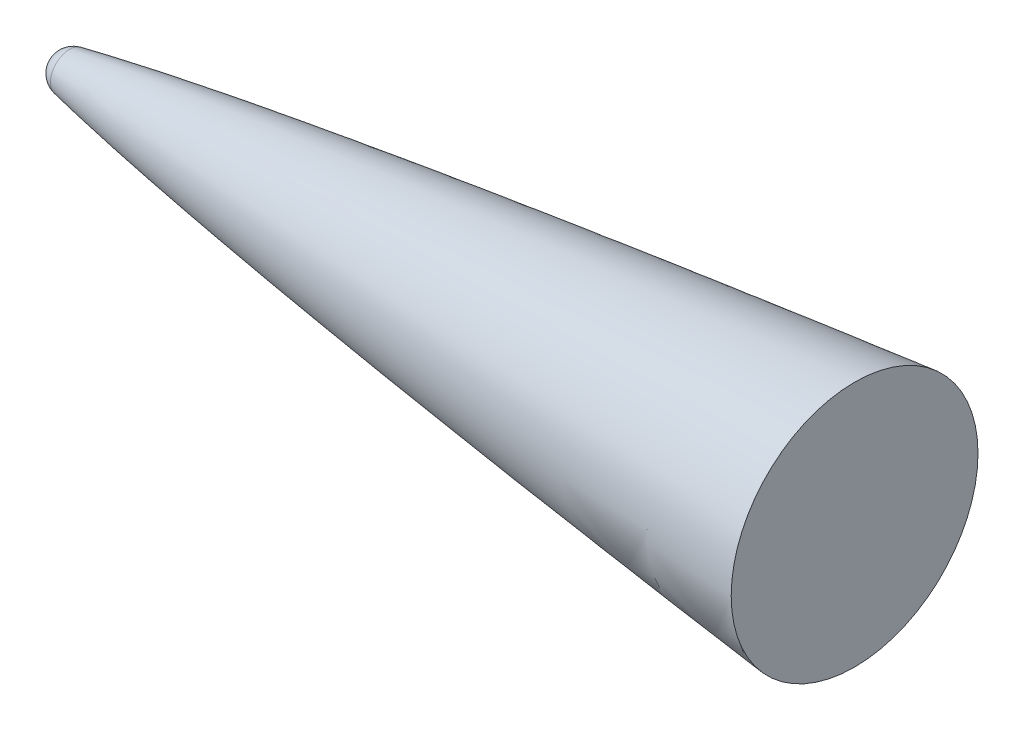
ISO-10303-21;
HEADER;
FILE_DESCRIPTION(('STEP AP214'),'2;1');
FILE_NAME('part.step','',(''),(''),'','','');
FILE_SCHEMA(('AUTOMOTIVE_DESIGN { 1 0 10303 214 1 1 1 1 }'));
ENDSEC;
DATA;
#1=APPLICATION_CONTEXT('core data for automotive mechanical design processes');
#2=APPLICATION_PROTOCOL_DEFINITION('international standard','automotive_design',2000,#1);
#3=PRODUCT_CONTEXT('',#1,'mechanical');
#4=PRODUCT('Part','Part','',(#3));
#5=PRODUCT_RELATED_PRODUCT_CATEGORY('part','',(#4));
#6=PRODUCT_DEFINITION_FORMATION('','',#4);
#7=PRODUCT_DEFINITION_CONTEXT('part definition',#1,'design');
#8=PRODUCT_DEFINITION('design','',#6,#7);
#9=PRODUCT_DEFINITION_SHAPE('','',#8);
#10=(LENGTH_UNIT() NAMED_UNIT(*) SI_UNIT(.MILLI.,.METRE.));
#11=(NAMED_UNIT(*) PLANE_ANGLE_UNIT() SI_UNIT($,.RADIAN.));
#12=(NAMED_UNIT(*) SI_UNIT($,.STERADIAN.) SOLID_ANGLE_UNIT());
#13=UNCERTAINTY_MEASURE_WITH_UNIT(LENGTH_MEASURE(1.E-05),#10,'distance_accuracy_value','');
#14=(GEOMETRIC_REPRESENTATION_CONTEXT(3) GLOBAL_UNCERTAINTY_ASSIGNED_CONTEXT((#13)) GLOBAL_UNIT_ASSIGNED_CONTEXT((#10,
#11,#12)) REPRESENTATION_CONTEXT('',''));
#15=CARTESIAN_POINT('',(0.,0.,0.));
#16=DIRECTION('',(0.,0.,1.));
#17=DIRECTION('',(1.,0.,0.));
#18=AXIS2_PLACEMENT_3D('',#15,#16,#17);
#19=CARTESIAN_POINT('',(132.41557463994,19.0940709125971,0.));
#20=CARTESIAN_POINT('',(131.30773362743,18.9742595068565,0.));
#21=CARTESIAN_POINT('',(129.115543687225,18.736229345081,0.));
#22=CARTESIAN_POINT('',(123.843949567547,18.161777829249,0.));
#23=CARTESIAN_POINT('',(119.614352441688,17.6924349808731,0.));
#24=CARTESIAN_POINT('',(113.709846900214,17.0354784655078,0.));
#25=CARTESIAN_POINT('',(108.815060586725,16.4808731453903,0.));
#26=CARTESIAN_POINT('',(103.309612299725,15.8529632462193,0.));
#27=CARTESIAN_POINT('',(98.1767678573921,15.2576254396695,0.));
#28=CARTESIAN_POINT('',(92.8182877112802,14.6296447277505,0.));
#29=CARTESIAN_POINT('',(87.599681842161,14.0079660376046,0.));
#30=CARTESIAN_POINT('',(82.2959597252162,13.3675978856731,0.));
#31=CARTESIAN_POINT('',(77.0489732942275,12.7231206944217,0.));
#32=CARTESIAN_POINT('',(72.4247858262904,12.1459052609211,0.));
#33=CARTESIAN_POINT('',(68.4837547959236,11.646000616909,0.));
#34=CARTESIAN_POINT('',(65.187951578899,11.2227405857574,0.));
#35=CARTESIAN_POINT('',(62.5581937674183,10.8814385314142,0.));
#36=CARTESIAN_POINT('',(59.2671339925591,10.4499336088328,0.));
#37=CARTESIAN_POINT('',(55.3208805282131,9.92479318669264,0.));
#38=CARTESIAN_POINT('',(50.7180346953579,9.30035541727738,0.));
#39=CARTESIAN_POINT('',(45.4592578488025,8.56809950599793,0.));
#40=CARTESIAN_POINT('',(40.2057451479226,7.81541559485168,0.));
#41=CARTESIAN_POINT('',(35.6079126762743,7.13465410169482,0.));
#42=CARTESIAN_POINT('',(31.676400472167,6.53450006851707,0.));
#43=CARTESIAN_POINT('',(28.3914211172568,6.01817430982453,0.));
#44=CARTESIAN_POINT('',(25.7845503587537,5.59972726590322,0.));
#45=CARTESIAN_POINT('',(23.139196633488,5.16264396592284,0.));
#46=CARTESIAN_POINT('',(20.5695762747035,4.7284528713164,0.));
#47=CARTESIAN_POINT('',(18.1726607191501,4.30681331721993,0.));
#48=CARTESIAN_POINT('',(16.2766422056688,3.96719352944553,0.));
#49=CARTESIAN_POINT('',(14.3837953929083,3.61285977807531,0.));
#50=CARTESIAN_POINT('',(13.2476442939395,3.39987791132279,0.));
#51=CARTESIAN_POINT('',(11.8018619423019,3.11477866230154,0.));
#52=CARTESIAN_POINT('',(11.2292816296337,3.00080309551267,0.));
#53=CARTESIAN_POINT('',(10.9314411794102,2.94071065855825,0.));
#54=B_SPLINE_CURVE_WITH_KNOTS('',4,(#19,#20,#21,#22,#23,#24,#25,#26,#27,#28,#29,#30,#31,#32,#33,
#34,#35,#36,#37,#38,#39,#40,#41,#42,#43,#44,#45,#46,#47,#48,#49,#50,#51,#52,#53),.UNSPECIFIED.,
.F.,.F.,(5,1,1,1,1,1,1,1,1,1,1,1,1,1,1,1,1,1,1,1,1,1,1,1,1,1,1,1,1,1,1,5),(0.0767189712256453,
0.113079875596668,0.149440779967691,0.185801684367338,0.222162588766985,0.258523493205499,
0.294884397644013,0.331245302111707,0.367606206579402,0.403967111055791,0.440328015532179,
0.476688920014092,0.513049824496006,0.531230276695744,0.549410728895482,0.567591181095221,
0.585771633294959,0.622132537592041,0.658493441889123,0.694854345933141,0.731215249977159,
0.767576153991412,0.785756605998539,0.803937058005665,0.822117509980411,0.840297961955156,
0.858478413929901,0.876658865904647,0.88657357958517,0.896488293265694,0.906403006946218,
0.916317720626741),.UNSPECIFIED.);
#55=CARTESIAN_POINT('',(132.41557463996,0.,0.));
#56=DIRECTION('',(1.,0.,0.));
#57=AXIS1_PLACEMENT('',#55,#56);
#58=SURFACE_OF_REVOLUTION('',#54,#57);
#59=CARTESIAN_POINT('',(10.9314411796068,0.,0.));
#60=DIRECTION('',(1.,0.,0.));
#61=DIRECTION('',(0.,1.,0.));
#62=AXIS2_PLACEMENT_3D('',#59,#60,#61);
#63=CIRCLE('',#62,2.94071065859793);
#64=CARTESIAN_POINT('',(10.9314411796068,2.94071065859792,0.));
#65=VERTEX_POINT('',#64);
#66=EDGE_CURVE('E10',#65,#65,#63,.T.);
#67=ORIENTED_EDGE('',*,*,#66,.T.);
#68=EDGE_LOOP('',(#67));
#69=FACE_BOUND('',#68,.T.);
#70=CARTESIAN_POINT('',(132.41557463996,0.,0.));
#71=DIRECTION('',(1.,0.,0.));
#72=DIRECTION('',(0.,1.,0.));
#73=AXIS2_PLACEMENT_3D('',#70,#71,#72);
#74=CIRCLE('',#73,19.094070912599);
#75=CARTESIAN_POINT('',(132.41557463996,19.094070912599,0.));
#76=VERTEX_POINT('',#75);
#77=EDGE_CURVE('E40',#76,#76,#74,.T.);
#78=ORIENTED_EDGE('',*,*,#77,.F.);
#79=EDGE_LOOP('',(#78));
#80=FACE_BOUND('',#79,.T.);
#81=ADVANCED_FACE('F33',(#69,#80),#58,.F.);
#82=CARTESIAN_POINT('',(11.5247604205707,-5.01213135419505E-11,0.));
#83=DIRECTION('',(1.,0.,0.));
#84=DIRECTION('',(0.,1.,0.));
#85=AXIS2_PLACEMENT_3D('',#82,#83,#84);
#86=SPHERICAL_SURFACE('',#85,2.99996781642474);
#87=ORIENTED_EDGE('',*,*,#66,.F.);
#88=EDGE_LOOP('',(#87));
#89=FACE_BOUND('',#88,.T.);
#90=ADVANCED_FACE('F55',(#89),#86,.T.);
#91=CARTESIAN_POINT('',(132.41557463996,19.094070912599,0.));
#92=DIRECTION('',(1.,0.,0.));
#93=DIRECTION('',(0.,1.,0.));
#94=AXIS2_PLACEMENT_3D('',#91,#92,#93);
#95=PLANE('',#94);
#96=ORIENTED_EDGE('',*,*,#77,.T.);
#97=EDGE_LOOP('',(#96));
#98=FACE_BOUND('',#97,.T.);
#99=ADVANCED_FACE('F52',(#98),#95,.T.);
#100=CLOSED_SHELL('',(#81,#90,#99));
#101=MANIFOLD_SOLID_BREP('B2',#100);
#102=ADVANCED_BREP_SHAPE_REPRESENTATION('',(#18,#101),#14);
#103=SHAPE_DEFINITION_REPRESENTATION(#9,#102);
ENDSEC;
END-ISO-10303-21;
